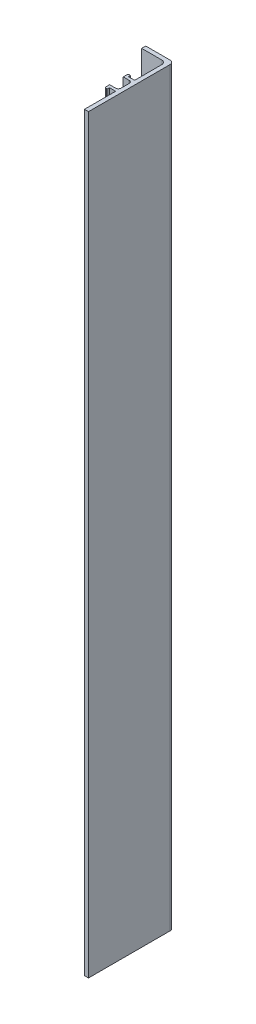
ISO-10303-21;
HEADER;
FILE_DESCRIPTION(('STEP AP214'),'2;1');
FILE_NAME('part.step','',(''),(''),'','','');
FILE_SCHEMA(('AUTOMOTIVE_DESIGN { 1 0 10303 214 1 1 1 1 }'));
ENDSEC;
DATA;
#1=APPLICATION_CONTEXT('core data for automotive mechanical design processes');
#2=APPLICATION_PROTOCOL_DEFINITION('international standard','automotive_design',2000,#1);
#3=PRODUCT_CONTEXT('',#1,'mechanical');
#4=PRODUCT('Part','Part','',(#3));
#5=PRODUCT_RELATED_PRODUCT_CATEGORY('part','',(#4));
#6=PRODUCT_DEFINITION_FORMATION('','',#4);
#7=PRODUCT_DEFINITION_CONTEXT('part definition',#1,'design');
#8=PRODUCT_DEFINITION('design','',#6,#7);
#9=PRODUCT_DEFINITION_SHAPE('','',#8);
#10=(LENGTH_UNIT() NAMED_UNIT(*) SI_UNIT(.MILLI.,.METRE.));
#11=(NAMED_UNIT(*) PLANE_ANGLE_UNIT() SI_UNIT($,.RADIAN.));
#12=(NAMED_UNIT(*) SI_UNIT($,.STERADIAN.) SOLID_ANGLE_UNIT());
#13=UNCERTAINTY_MEASURE_WITH_UNIT(LENGTH_MEASURE(1.E-05),#10,'distance_accuracy_value','');
#14=(GEOMETRIC_REPRESENTATION_CONTEXT(3) GLOBAL_UNCERTAINTY_ASSIGNED_CONTEXT((#13)) GLOBAL_UNIT_ASSIGNED_CONTEXT((#10,
#11,#12)) REPRESENTATION_CONTEXT('',''));
#15=CARTESIAN_POINT('',(0.,0.,0.));
#16=DIRECTION('',(0.,0.,1.));
#17=DIRECTION('',(1.,0.,0.));
#18=AXIS2_PLACEMENT_3D('',#15,#16,#17);
#19=CARTESIAN_POINT('',(-1.5,276.5,0.));
#20=DIRECTION('',(0.,0.,-1.));
#21=DIRECTION('',(-1.,0.,0.));
#22=AXIS2_PLACEMENT_3D('',#19,#20,#21);
#23=PLANE('',#22);
#24=DIRECTION('',(1.,0.,0.));
#25=VECTOR('',#24,1.);
#26=CARTESIAN_POINT('',(-1.5,0.,0.));
#27=LINE('',#26,#25);
#28=CARTESIAN_POINT('',(-1.5,0.,0.));
#29=VERTEX_POINT('',#28);
#30=CARTESIAN_POINT('',(0.,0.,0.));
#31=VERTEX_POINT('',#30);
#32=EDGE_CURVE('E220',#29,#31,#27,.T.);
#33=ORIENTED_EDGE('',*,*,#32,.T.);
#34=DIRECTION('',(0.,-1.,0.));
#35=VECTOR('',#34,1.);
#36=CARTESIAN_POINT('',(0.,276.5,0.));
#37=LINE('',#36,#35);
#38=CARTESIAN_POINT('',(0.,276.5,0.));
#39=VERTEX_POINT('',#38);
#40=EDGE_CURVE('E201',#39,#31,#37,.T.);
#41=ORIENTED_EDGE('',*,*,#40,.F.);
#42=DIRECTION('',(1.,0.,0.));
#43=VECTOR('',#42,1.);
#44=CARTESIAN_POINT('',(-1.5,276.5,0.));
#45=LINE('',#44,#43);
#46=CARTESIAN_POINT('',(-1.5,276.5,0.));
#47=VERTEX_POINT('',#46);
#48=EDGE_CURVE('E207',#47,#39,#45,.T.);
#49=ORIENTED_EDGE('',*,*,#48,.F.);
#50=DIRECTION('',(0.,-1.,0.));
#51=VECTOR('',#50,1.);
#52=CARTESIAN_POINT('',(-1.5,276.5,0.));
#53=LINE('',#52,#51);
#54=EDGE_CURVE('E367',#47,#29,#53,.T.);
#55=ORIENTED_EDGE('',*,*,#54,.T.);
#56=EDGE_LOOP('',(#33,#41,#49,#55));
#57=FACE_BOUND('',#56,.T.);
#58=ADVANCED_FACE('F39',(#57),#23,.F.);
#59=CARTESIAN_POINT('',(0.,276.5,0.));
#60=DIRECTION('',(-1.,0.,0.));
#61=DIRECTION('',(0.,0.,1.));
#62=AXIS2_PLACEMENT_3D('',#59,#60,#61);
#63=PLANE('',#62);
#64=DIRECTION('',(0.,0.,-1.));
#65=VECTOR('',#64,1.);
#66=CARTESIAN_POINT('',(0.,0.,0.));
#67=LINE('',#66,#65);
#68=CARTESIAN_POINT('',(0.,0.,-30.));
#69=VERTEX_POINT('',#68);
#70=EDGE_CURVE('E313',#31,#69,#67,.T.);
#71=ORIENTED_EDGE('',*,*,#70,.T.);
#72=DIRECTION('',(0.,-1.,0.));
#73=VECTOR('',#72,1.);
#74=CARTESIAN_POINT('',(0.,276.5,-30.));
#75=LINE('',#74,#73);
#76=CARTESIAN_POINT('',(0.,276.5,-30.));
#77=VERTEX_POINT('',#76);
#78=EDGE_CURVE('E48',#69,#77,#75,.F.);
#79=ORIENTED_EDGE('',*,*,#78,.T.);
#80=DIRECTION('',(0.,0.,-1.));
#81=VECTOR('',#80,1.);
#82=CARTESIAN_POINT('',(0.,276.5,0.));
#83=LINE('',#82,#81);
#84=EDGE_CURVE('E197',#39,#77,#83,.T.);
#85=ORIENTED_EDGE('',*,*,#84,.F.);
#86=ORIENTED_EDGE('',*,*,#40,.T.);
#87=EDGE_LOOP('',(#71,#79,#85,#86));
#88=FACE_BOUND('',#87,.T.);
#89=ADVANCED_FACE('F199',(#88),#63,.F.);
#90=CARTESIAN_POINT('',(0.,276.5,-31.5));
#91=DIRECTION('',(0.,0.,1.));
#92=DIRECTION('',(1.,0.,0.));
#93=AXIS2_PLACEMENT_3D('',#90,#91,#92);
#94=PLANE('',#93);
#95=DIRECTION('',(-1.,0.,0.));
#96=VECTOR('',#95,1.);
#97=CARTESIAN_POINT('',(0.,276.5,-31.5));
#98=LINE('',#97,#96);
#99=CARTESIAN_POINT('',(-1.5,276.5,-31.5));
#100=VERTEX_POINT('',#99);
#101=CARTESIAN_POINT('',(-10.4,276.5,-31.5));
#102=VERTEX_POINT('',#101);
#103=EDGE_CURVE('E206',#100,#102,#98,.T.);
#104=ORIENTED_EDGE('',*,*,#103,.F.);
#105=DIRECTION('',(0.,-1.,0.));
#106=VECTOR('',#105,1.);
#107=CARTESIAN_POINT('',(-1.5,276.5,-31.5));
#108=LINE('',#107,#106);
#109=CARTESIAN_POINT('',(-1.5,0.,-31.5));
#110=VERTEX_POINT('',#109);
#111=EDGE_CURVE('E295',#100,#110,#108,.T.);
#112=ORIENTED_EDGE('',*,*,#111,.T.);
#113=DIRECTION('',(-1.,0.,0.));
#114=VECTOR('',#113,1.);
#115=CARTESIAN_POINT('',(0.,0.,-31.5));
#116=LINE('',#115,#114);
#117=CARTESIAN_POINT('',(-10.4,0.,-31.5));
#118=VERTEX_POINT('',#117);
#119=EDGE_CURVE('E306',#110,#118,#116,.T.);
#120=ORIENTED_EDGE('',*,*,#119,.T.);
#121=DIRECTION('',(0.,-1.,0.));
#122=VECTOR('',#121,1.);
#123=CARTESIAN_POINT('',(-10.4,276.5,-31.5));
#124=LINE('',#123,#122);
#125=EDGE_CURVE('E223',#102,#118,#124,.T.);
#126=ORIENTED_EDGE('',*,*,#125,.F.);
#127=EDGE_LOOP('',(#104,#112,#120,#126));
#128=FACE_BOUND('',#127,.T.);
#129=ADVANCED_FACE('F304',(#128),#94,.F.);
#130=CARTESIAN_POINT('',(-10.4,276.5,-31.5));
#131=DIRECTION('',(1.,0.,0.));
#132=DIRECTION('',(0.,0.,-1.));
#133=AXIS2_PLACEMENT_3D('',#130,#131,#132);
#134=PLANE('',#133);
#135=DIRECTION('',(0.,0.,1.));
#136=VECTOR('',#135,1.);
#137=CARTESIAN_POINT('',(-10.4,0.,-31.5));
#138=LINE('',#137,#136);
#139=CARTESIAN_POINT('',(-10.4,0.,-30.));
#140=VERTEX_POINT('',#139);
#141=EDGE_CURVE('E311',#118,#140,#138,.T.);
#142=ORIENTED_EDGE('',*,*,#141,.T.);
#143=DIRECTION('',(0.,-1.,0.));
#144=VECTOR('',#143,1.);
#145=CARTESIAN_POINT('',(-10.4,276.5,-30.));
#146=LINE('',#145,#144);
#147=CARTESIAN_POINT('',(-10.4,276.5,-30.));
#148=VERTEX_POINT('',#147);
#149=EDGE_CURVE('E231',#148,#140,#146,.T.);
#150=ORIENTED_EDGE('',*,*,#149,.F.);
#151=DIRECTION('',(0.,0.,1.));
#152=VECTOR('',#151,1.);
#153=CARTESIAN_POINT('',(-10.4,276.5,-31.5));
#154=LINE('',#153,#152);
#155=EDGE_CURVE('E431',#102,#148,#154,.T.);
#156=ORIENTED_EDGE('',*,*,#155,.F.);
#157=ORIENTED_EDGE('',*,*,#125,.T.);
#158=EDGE_LOOP('',(#142,#150,#156,#157));
#159=FACE_BOUND('',#158,.T.);
#160=ADVANCED_FACE('F482',(#159),#134,.F.);
#161=CARTESIAN_POINT('',(-10.4,276.5,-30.));
#162=DIRECTION('',(0.,0.,-1.));
#163=DIRECTION('',(-1.,0.,0.));
#164=AXIS2_PLACEMENT_3D('',#161,#162,#163);
#165=PLANE('',#164);
#166=DIRECTION('',(1.,0.,0.));
#167=VECTOR('',#166,1.);
#168=CARTESIAN_POINT('',(-10.4,0.,-30.));
#169=LINE('',#168,#167);
#170=CARTESIAN_POINT('',(-3.,0.,-30.));
#171=VERTEX_POINT('',#170);
#172=EDGE_CURVE('E317',#140,#171,#169,.T.);
#173=ORIENTED_EDGE('',*,*,#172,.T.);
#174=DIRECTION('',(0.,-1.,0.));
#175=VECTOR('',#174,1.);
#176=CARTESIAN_POINT('',(-3.,276.5,-30.));
#177=LINE('',#176,#175);
#178=CARTESIAN_POINT('',(-3.,276.5,-30.));
#179=VERTEX_POINT('',#178);
#180=EDGE_CURVE('E286',#171,#179,#177,.F.);
#181=ORIENTED_EDGE('',*,*,#180,.T.);
#182=DIRECTION('',(1.,0.,0.));
#183=VECTOR('',#182,1.);
#184=CARTESIAN_POINT('',(-10.4,276.5,-30.));
#185=LINE('',#184,#183);
#186=EDGE_CURVE('E409',#148,#179,#185,.T.);
#187=ORIENTED_EDGE('',*,*,#186,.F.);
#188=ORIENTED_EDGE('',*,*,#149,.T.);
#189=EDGE_LOOP('',(#173,#181,#187,#188));
#190=FACE_BOUND('',#189,.T.);
#191=ADVANCED_FACE('F406',(#190),#165,.F.);
#192=CARTESIAN_POINT('',(-1.5,276.5,-30.));
#193=DIRECTION('',(1.,0.,0.));
#194=DIRECTION('',(0.,0.,-1.));
#195=AXIS2_PLACEMENT_3D('',#192,#193,#194);
#196=PLANE('',#195);
#197=DIRECTION('',(0.,0.,1.));
#198=VECTOR('',#197,1.);
#199=CARTESIAN_POINT('',(-1.5,276.5,-30.));
#200=LINE('',#199,#198);
#201=CARTESIAN_POINT('',(-1.5,276.5,-28.5));
#202=VERTEX_POINT('',#201);
#203=CARTESIAN_POINT('',(-1.5,276.5,-18.5));
#204=VERTEX_POINT('',#203);
#205=EDGE_CURVE('E422',#202,#204,#200,.T.);
#206=ORIENTED_EDGE('',*,*,#205,.F.);
#207=DIRECTION('',(0.,-1.,0.));
#208=VECTOR('',#207,1.);
#209=CARTESIAN_POINT('',(-1.5,0.,-28.5));
#210=LINE('',#209,#208);
#211=CARTESIAN_POINT('',(-1.5,0.,-28.5));
#212=VERTEX_POINT('',#211);
#213=EDGE_CURVE('E282',#202,#212,#210,.T.);
#214=ORIENTED_EDGE('',*,*,#213,.T.);
#215=DIRECTION('',(0.,0.,1.));
#216=VECTOR('',#215,1.);
#217=CARTESIAN_POINT('',(-1.5,0.,-30.));
#218=LINE('',#217,#216);
#219=CARTESIAN_POINT('',(-1.5,0.,-18.5));
#220=VERTEX_POINT('',#219);
#221=EDGE_CURVE('E325',#212,#220,#218,.T.);
#222=ORIENTED_EDGE('',*,*,#221,.T.);
#223=DIRECTION('',(0.,-1.,0.));
#224=VECTOR('',#223,1.);
#225=CARTESIAN_POINT('',(-1.5,276.5,-18.5));
#226=LINE('',#225,#224);
#227=EDGE_CURVE('E398',#204,#220,#226,.T.);
#228=ORIENTED_EDGE('',*,*,#227,.F.);
#229=EDGE_LOOP('',(#206,#214,#222,#228));
#230=FACE_BOUND('',#229,.T.);
#231=ADVANCED_FACE('F420',(#230),#196,.F.);
#232=CARTESIAN_POINT('',(-1.5,276.5,-18.5));
#233=DIRECTION('',(0.,0.,1.));
#234=DIRECTION('',(1.,0.,0.));
#235=AXIS2_PLACEMENT_3D('',#232,#233,#234);
#236=PLANE('',#235);
#237=DIRECTION('',(-1.,0.,0.));
#238=VECTOR('',#237,1.);
#239=CARTESIAN_POINT('',(-1.5,0.,-18.5));
#240=LINE('',#239,#238);
#241=CARTESIAN_POINT('',(-3.8,0.,-18.5));
#242=VERTEX_POINT('',#241);
#243=EDGE_CURVE('E328',#220,#242,#240,.T.);
#244=ORIENTED_EDGE('',*,*,#243,.T.);
#245=DIRECTION('',(0.,-1.,0.));
#246=VECTOR('',#245,1.);
#247=CARTESIAN_POINT('',(-3.8,276.5,-18.5));
#248=LINE('',#247,#246);
#249=CARTESIAN_POINT('',(-3.8,276.5,-18.5));
#250=VERTEX_POINT('',#249);
#251=EDGE_CURVE('E394',#250,#242,#248,.T.);
#252=ORIENTED_EDGE('',*,*,#251,.F.);
#253=DIRECTION('',(-1.,0.,0.));
#254=VECTOR('',#253,1.);
#255=CARTESIAN_POINT('',(-1.5,276.5,-18.5));
#256=LINE('',#255,#254);
#257=EDGE_CURVE('E425',#204,#250,#256,.T.);
#258=ORIENTED_EDGE('',*,*,#257,.F.);
#259=ORIENTED_EDGE('',*,*,#227,.T.);
#260=EDGE_LOOP('',(#244,#252,#258,#259));
#261=FACE_BOUND('',#260,.T.);
#262=ADVANCED_FACE('F567',(#261),#236,.F.);
#263=CARTESIAN_POINT('',(-3.8,276.5,-18.5));
#264=DIRECTION('',(-1.,0.,0.));
#265=DIRECTION('',(0.,0.,1.));
#266=AXIS2_PLACEMENT_3D('',#263,#264,#265);
#267=PLANE('',#266);
#268=DIRECTION('',(0.,0.,-1.));
#269=VECTOR('',#268,1.);
#270=CARTESIAN_POINT('',(-3.8,0.,-18.5));
#271=LINE('',#270,#269);
#272=CARTESIAN_POINT('',(-3.8,0.,-19.3));
#273=VERTEX_POINT('',#272);
#274=EDGE_CURVE('E331',#242,#273,#271,.T.);
#275=ORIENTED_EDGE('',*,*,#274,.T.);
#276=DIRECTION('',(0.,-1.,0.));
#277=VECTOR('',#276,1.);
#278=CARTESIAN_POINT('',(-3.8,276.5,-19.3));
#279=LINE('',#278,#277);
#280=CARTESIAN_POINT('',(-3.8,276.5,-19.3));
#281=VERTEX_POINT('',#280);
#282=EDGE_CURVE('E390',#281,#273,#279,.T.);
#283=ORIENTED_EDGE('',*,*,#282,.F.);
#284=DIRECTION('',(0.,0.,-1.));
#285=VECTOR('',#284,1.);
#286=CARTESIAN_POINT('',(-3.8,276.5,-18.5));
#287=LINE('',#286,#285);
#288=EDGE_CURVE('E429',#250,#281,#287,.T.);
#289=ORIENTED_EDGE('',*,*,#288,.F.);
#290=ORIENTED_EDGE('',*,*,#251,.T.);
#291=EDGE_LOOP('',(#275,#283,#289,#290));
#292=FACE_BOUND('',#291,.T.);
#293=ADVANCED_FACE('F670',(#292),#267,.F.);
#294=CARTESIAN_POINT('',(-4.7,276.5,-19.3));
#295=DIRECTION('',(0.,0.,1.));
#296=DIRECTION('',(1.,0.,0.));
#297=AXIS2_PLACEMENT_3D('',#294,#295,#296);
#298=PLANE('',#297);
#299=DIRECTION('',(-1.,0.,0.));
#300=VECTOR('',#299,1.);
#301=CARTESIAN_POINT('',(-4.7,0.,-19.3));
#302=LINE('',#301,#300);
#303=CARTESIAN_POINT('',(-4.2,0.,-19.3));
#304=VERTEX_POINT('',#303);
#305=EDGE_CURVE('E334',#273,#304,#302,.T.);
#306=ORIENTED_EDGE('',*,*,#305,.T.);
#307=DIRECTION('',(0.,-1.,0.));
#308=VECTOR('',#307,1.);
#309=CARTESIAN_POINT('',(-4.2,276.5,-19.3));
#310=LINE('',#309,#308);
#311=CARTESIAN_POINT('',(-4.2,276.5,-19.3));
#312=VERTEX_POINT('',#311);
#313=EDGE_CURVE('E253',#304,#312,#310,.F.);
#314=ORIENTED_EDGE('',*,*,#313,.T.);
#315=DIRECTION('',(-1.,0.,0.));
#316=VECTOR('',#315,1.);
#317=CARTESIAN_POINT('',(-4.7,276.5,-19.3));
#318=LINE('',#317,#316);
#319=EDGE_CURVE('E437',#281,#312,#318,.T.);
#320=ORIENTED_EDGE('',*,*,#319,.F.);
#321=ORIENTED_EDGE('',*,*,#282,.T.);
#322=EDGE_LOOP('',(#306,#314,#320,#321));
#323=FACE_BOUND('',#322,.T.);
#324=ADVANCED_FACE('F660',(#323),#298,.F.);
#325=CARTESIAN_POINT('',(-4.7,276.5,-19.3));
#326=DIRECTION('',(1.,0.,0.));
#327=DIRECTION('',(0.,0.,-1.));
#328=AXIS2_PLACEMENT_3D('',#325,#326,#327);
#329=PLANE('',#328);
#330=DIRECTION('',(0.,0.,1.));
#331=VECTOR('',#330,1.);
#332=CARTESIAN_POINT('',(-4.7,276.5,-19.3));
#333=LINE('',#332,#331);
#334=CARTESIAN_POINT('',(-4.7,276.5,-18.8));
#335=VERTEX_POINT('',#334);
#336=CARTESIAN_POINT('',(-4.7,276.5,-17.5));
#337=VERTEX_POINT('',#336);
#338=EDGE_CURVE('E441',#335,#337,#333,.T.);
#339=ORIENTED_EDGE('',*,*,#338,.F.);
#340=DIRECTION('',(0.,-1.,0.));
#341=VECTOR('',#340,1.);
#342=CARTESIAN_POINT('',(-4.7,276.5,-18.8));
#343=LINE('',#342,#341);
#344=CARTESIAN_POINT('',(-4.7,0.,-18.8));
#345=VERTEX_POINT('',#344);
#346=EDGE_CURVE('E249',#335,#345,#343,.T.);
#347=ORIENTED_EDGE('',*,*,#346,.T.);
#348=DIRECTION('',(0.,0.,1.));
#349=VECTOR('',#348,1.);
#350=CARTESIAN_POINT('',(-4.7,0.,-19.3));
#351=LINE('',#350,#349);
#352=CARTESIAN_POINT('',(-4.7,0.,-17.5));
#353=VERTEX_POINT('',#352);
#354=EDGE_CURVE('E338',#345,#353,#351,.T.);
#355=ORIENTED_EDGE('',*,*,#354,.T.);
#356=DIRECTION('',(0.,-1.,0.));
#357=VECTOR('',#356,1.);
#358=CARTESIAN_POINT('',(-4.7,276.5,-17.5));
#359=LINE('',#358,#357);
#360=EDGE_CURVE('E386',#337,#353,#359,.T.);
#361=ORIENTED_EDGE('',*,*,#360,.F.);
#362=EDGE_LOOP('',(#339,#347,#355,#361));
#363=FACE_BOUND('',#362,.T.);
#364=ADVANCED_FACE('F620',(#363),#329,.F.);
#365=CARTESIAN_POINT('',(-4.7,276.5,-17.5));
#366=DIRECTION('',(0.,0.,-1.));
#367=DIRECTION('',(-1.,0.,0.));
#368=AXIS2_PLACEMENT_3D('',#365,#366,#367);
#369=PLANE('',#368);
#370=DIRECTION('',(1.,0.,0.));
#371=VECTOR('',#370,1.);
#372=CARTESIAN_POINT('',(-4.7,0.,-17.5));
#373=LINE('',#372,#371);
#374=CARTESIAN_POINT('',(-2.5,0.,-17.5));
#375=VERTEX_POINT('',#374);
#376=EDGE_CURVE('E341',#353,#375,#373,.T.);
#377=ORIENTED_EDGE('',*,*,#376,.T.);
#378=DIRECTION('',(0.,-1.,0.));
#379=VECTOR('',#378,1.);
#380=CARTESIAN_POINT('',(-2.5,276.5,-17.5));
#381=LINE('',#380,#379);
#382=CARTESIAN_POINT('',(-2.5,276.5,-17.5));
#383=VERTEX_POINT('',#382);
#384=EDGE_CURVE('E267',#375,#383,#381,.F.);
#385=ORIENTED_EDGE('',*,*,#384,.T.);
#386=DIRECTION('',(1.,0.,0.));
#387=VECTOR('',#386,1.);
#388=CARTESIAN_POINT('',(-4.7,276.5,-17.5));
#389=LINE('',#388,#387);
#390=EDGE_CURVE('E444',#337,#383,#389,.T.);
#391=ORIENTED_EDGE('',*,*,#390,.F.);
#392=ORIENTED_EDGE('',*,*,#360,.T.);
#393=EDGE_LOOP('',(#377,#385,#391,#392));
#394=FACE_BOUND('',#393,.T.);
#395=ADVANCED_FACE('F610',(#394),#369,.F.);
#396=CARTESIAN_POINT('',(-1.5,276.5,-17.5));
#397=DIRECTION('',(1.,0.,0.));
#398=DIRECTION('',(0.,0.,-1.));
#399=AXIS2_PLACEMENT_3D('',#396,#397,#398);
#400=PLANE('',#399);
#401=DIRECTION('',(0.,0.,1.));
#402=VECTOR('',#401,1.);
#403=CARTESIAN_POINT('',(-1.5,0.,-17.5));
#404=LINE('',#403,#402);
#405=CARTESIAN_POINT('',(-1.5,0.,-16.5));
#406=VERTEX_POINT('',#405);
#407=CARTESIAN_POINT('',(-1.5,0.,-13.5));
#408=VERTEX_POINT('',#407);
#409=EDGE_CURVE('E345',#406,#408,#404,.T.);
#410=ORIENTED_EDGE('',*,*,#409,.T.);
#411=DIRECTION('',(0.,-1.,0.));
#412=VECTOR('',#411,1.);
#413=CARTESIAN_POINT('',(-1.5,276.5,-13.5));
#414=LINE('',#413,#412);
#415=CARTESIAN_POINT('',(-1.5,276.5,-13.5));
#416=VERTEX_POINT('',#415);
#417=EDGE_CURVE('E264',#408,#416,#414,.F.);
#418=ORIENTED_EDGE('',*,*,#417,.T.);
#419=DIRECTION('',(0.,0.,1.));
#420=VECTOR('',#419,1.);
#421=CARTESIAN_POINT('',(-1.5,276.5,-17.5));
#422=LINE('',#421,#420);
#423=CARTESIAN_POINT('',(-1.5,276.5,-16.5));
#424=VERTEX_POINT('',#423);
#425=EDGE_CURVE('E448',#424,#416,#422,.T.);
#426=ORIENTED_EDGE('',*,*,#425,.F.);
#427=DIRECTION('',(0.,-1.,0.));
#428=VECTOR('',#427,1.);
#429=CARTESIAN_POINT('',(-1.5,0.,-16.5));
#430=LINE('',#429,#428);
#431=EDGE_CURVE('E260',#424,#406,#430,.T.);
#432=ORIENTED_EDGE('',*,*,#431,.T.);
#433=EDGE_LOOP('',(#410,#418,#426,#432));
#434=FACE_BOUND('',#433,.T.);
#435=ADVANCED_FACE('F598',(#434),#400,.F.);
#436=CARTESIAN_POINT('',(-1.5,276.5,-12.5));
#437=DIRECTION('',(0.,0.,1.));
#438=DIRECTION('',(1.,0.,0.));
#439=AXIS2_PLACEMENT_3D('',#436,#437,#438);
#440=PLANE('',#439);
#441=DIRECTION('',(-1.,0.,0.));
#442=VECTOR('',#441,1.);
#443=CARTESIAN_POINT('',(-1.5,276.5,-12.5));
#444=LINE('',#443,#442);
#445=CARTESIAN_POINT('',(-2.5,276.5,-12.5));
#446=VERTEX_POINT('',#445);
#447=CARTESIAN_POINT('',(-4.7,276.5,-12.5));
#448=VERTEX_POINT('',#447);
#449=EDGE_CURVE('E452',#446,#448,#444,.T.);
#450=ORIENTED_EDGE('',*,*,#449,.F.);
#451=DIRECTION('',(0.,-1.,0.));
#452=VECTOR('',#451,1.);
#453=CARTESIAN_POINT('',(-2.5,0.,-12.5));
#454=LINE('',#453,#452);
#455=CARTESIAN_POINT('',(-2.5,0.,-12.5));
#456=VERTEX_POINT('',#455);
#457=EDGE_CURVE('E256',#446,#456,#454,.T.);
#458=ORIENTED_EDGE('',*,*,#457,.T.);
#459=DIRECTION('',(-1.,0.,0.));
#460=VECTOR('',#459,1.);
#461=CARTESIAN_POINT('',(-1.5,0.,-12.5));
#462=LINE('',#461,#460);
#463=CARTESIAN_POINT('',(-4.7,0.,-12.5));
#464=VERTEX_POINT('',#463);
#465=EDGE_CURVE('E349',#456,#464,#462,.T.);
#466=ORIENTED_EDGE('',*,*,#465,.T.);
#467=DIRECTION('',(0.,-1.,0.));
#468=VECTOR('',#467,1.);
#469=CARTESIAN_POINT('',(-4.7,276.5,-12.5));
#470=LINE('',#469,#468);
#471=EDGE_CURVE('E382',#448,#464,#470,.T.);
#472=ORIENTED_EDGE('',*,*,#471,.F.);
#473=EDGE_LOOP('',(#450,#458,#466,#472));
#474=FACE_BOUND('',#473,.T.);
#475=ADVANCED_FACE('F592',(#474),#440,.F.);
#476=CARTESIAN_POINT('',(-4.7,276.5,-12.5));
#477=DIRECTION('',(1.,0.,0.));
#478=DIRECTION('',(0.,0.,-1.));
#479=AXIS2_PLACEMENT_3D('',#476,#477,#478);
#480=PLANE('',#479);
#481=DIRECTION('',(0.,0.,1.));
#482=VECTOR('',#481,1.);
#483=CARTESIAN_POINT('',(-4.7,0.,-12.5));
#484=LINE('',#483,#482);
#485=CARTESIAN_POINT('',(-4.7,0.,-11.2));
#486=VERTEX_POINT('',#485);
#487=EDGE_CURVE('E352',#464,#486,#484,.T.);
#488=ORIENTED_EDGE('',*,*,#487,.T.);
#489=DIRECTION('',(0.,-1.,0.));
#490=VECTOR('',#489,1.);
#491=CARTESIAN_POINT('',(-4.7,276.5,-11.2));
#492=LINE('',#491,#490);
#493=CARTESIAN_POINT('',(-4.7,276.5,-11.2));
#494=VERTEX_POINT('',#493);
#495=EDGE_CURVE('E240',#486,#494,#492,.F.);
#496=ORIENTED_EDGE('',*,*,#495,.T.);
#497=DIRECTION('',(0.,0.,1.));
#498=VECTOR('',#497,1.);
#499=CARTESIAN_POINT('',(-4.7,276.5,-12.5));
#500=LINE('',#499,#498);
#501=EDGE_CURVE('E455',#448,#494,#500,.T.);
#502=ORIENTED_EDGE('',*,*,#501,.F.);
#503=ORIENTED_EDGE('',*,*,#471,.T.);
#504=EDGE_LOOP('',(#488,#496,#502,#503));
#505=FACE_BOUND('',#504,.T.);
#506=ADVANCED_FACE('F597',(#505),#480,.F.);
#507=CARTESIAN_POINT('',(-4.7,276.5,-10.7));
#508=DIRECTION('',(0.,0.,-1.));
#509=DIRECTION('',(-1.,0.,0.));
#510=AXIS2_PLACEMENT_3D('',#507,#508,#509);
#511=PLANE('',#510);
#512=DIRECTION('',(1.,0.,0.));
#513=VECTOR('',#512,1.);
#514=CARTESIAN_POINT('',(-4.7,276.5,-10.7));
#515=LINE('',#514,#513);
#516=CARTESIAN_POINT('',(-4.2,276.5,-10.7));
#517=VERTEX_POINT('',#516);
#518=CARTESIAN_POINT('',(-3.8,276.5,-10.7));
#519=VERTEX_POINT('',#518);
#520=EDGE_CURVE('E459',#517,#519,#515,.T.);
#521=ORIENTED_EDGE('',*,*,#520,.F.);
#522=DIRECTION('',(0.,-1.,0.));
#523=VECTOR('',#522,1.);
#524=CARTESIAN_POINT('',(-4.2,276.5,-10.7));
#525=LINE('',#524,#523);
#526=CARTESIAN_POINT('',(-4.2,0.,-10.7));
#527=VERTEX_POINT('',#526);
#528=EDGE_CURVE('E222',#517,#527,#525,.T.);
#529=ORIENTED_EDGE('',*,*,#528,.T.);
#530=DIRECTION('',(1.,0.,0.));
#531=VECTOR('',#530,1.);
#532=CARTESIAN_POINT('',(-4.7,0.,-10.7));
#533=LINE('',#532,#531);
#534=CARTESIAN_POINT('',(-3.8,0.,-10.7));
#535=VERTEX_POINT('',#534);
#536=EDGE_CURVE('E356',#527,#535,#533,.T.);
#537=ORIENTED_EDGE('',*,*,#536,.T.);
#538=DIRECTION('',(0.,-1.,0.));
#539=VECTOR('',#538,1.);
#540=CARTESIAN_POINT('',(-3.8,276.5,-10.7));
#541=LINE('',#540,#539);
#542=EDGE_CURVE('E378',#519,#535,#541,.T.);
#543=ORIENTED_EDGE('',*,*,#542,.F.);
#544=EDGE_LOOP('',(#521,#529,#537,#543));
#545=FACE_BOUND('',#544,.T.);
#546=ADVANCED_FACE('F638',(#545),#511,.F.);
#547=CARTESIAN_POINT('',(-3.8,276.5,-11.5));
#548=DIRECTION('',(-1.,0.,0.));
#549=DIRECTION('',(0.,0.,1.));
#550=AXIS2_PLACEMENT_3D('',#547,#548,#549);
#551=PLANE('',#550);
#552=DIRECTION('',(0.,0.,-1.));
#553=VECTOR('',#552,1.);
#554=CARTESIAN_POINT('',(-3.8,0.,-11.5));
#555=LINE('',#554,#553);
#556=CARTESIAN_POINT('',(-3.8,0.,-11.5));
#557=VERTEX_POINT('',#556);
#558=EDGE_CURVE('E359',#535,#557,#555,.T.);
#559=ORIENTED_EDGE('',*,*,#558,.T.);
#560=DIRECTION('',(0.,-1.,0.));
#561=VECTOR('',#560,1.);
#562=CARTESIAN_POINT('',(-3.8,276.5,-11.5));
#563=LINE('',#562,#561);
#564=CARTESIAN_POINT('',(-3.8,276.5,-11.5));
#565=VERTEX_POINT('',#564);
#566=EDGE_CURVE('E374',#565,#557,#563,.T.);
#567=ORIENTED_EDGE('',*,*,#566,.F.);
#568=DIRECTION('',(0.,0.,-1.));
#569=VECTOR('',#568,1.);
#570=CARTESIAN_POINT('',(-3.8,276.5,-11.5));
#571=LINE('',#570,#569);
#572=EDGE_CURVE('E462',#519,#565,#571,.T.);
#573=ORIENTED_EDGE('',*,*,#572,.F.);
#574=ORIENTED_EDGE('',*,*,#542,.T.);
#575=EDGE_LOOP('',(#559,#567,#573,#574));
#576=FACE_BOUND('',#575,.T.);
#577=ADVANCED_FACE('F643',(#576),#551,.F.);
#578=CARTESIAN_POINT('',(-3.8,276.5,-11.5));
#579=DIRECTION('',(0.,0.,-1.));
#580=DIRECTION('',(-1.,0.,0.));
#581=AXIS2_PLACEMENT_3D('',#578,#579,#580);
#582=PLANE('',#581);
#583=DIRECTION('',(1.,0.,0.));
#584=VECTOR('',#583,1.);
#585=CARTESIAN_POINT('',(-3.8,0.,-11.5));
#586=LINE('',#585,#584);
#587=CARTESIAN_POINT('',(-1.5,0.,-11.5));
#588=VERTEX_POINT('',#587);
#589=EDGE_CURVE('E362',#557,#588,#586,.T.);
#590=ORIENTED_EDGE('',*,*,#589,.T.);
#591=DIRECTION('',(0.,-1.,0.));
#592=VECTOR('',#591,1.);
#593=CARTESIAN_POINT('',(-1.5,276.5,-11.5));
#594=LINE('',#593,#592);
#595=CARTESIAN_POINT('',(-1.5,276.5,-11.5));
#596=VERTEX_POINT('',#595);
#597=EDGE_CURVE('E370',#596,#588,#594,.T.);
#598=ORIENTED_EDGE('',*,*,#597,.F.);
#599=DIRECTION('',(1.,0.,0.));
#600=VECTOR('',#599,1.);
#601=CARTESIAN_POINT('',(-3.8,276.5,-11.5));
#602=LINE('',#601,#600);
#603=EDGE_CURVE('E465',#565,#596,#602,.T.);
#604=ORIENTED_EDGE('',*,*,#603,.F.);
#605=ORIENTED_EDGE('',*,*,#566,.T.);
#606=EDGE_LOOP('',(#590,#598,#604,#605));
#607=FACE_BOUND('',#606,.T.);
#608=ADVANCED_FACE('F475',(#607),#582,.F.);
#609=CARTESIAN_POINT('',(-1.5,276.5,-11.5));
#610=DIRECTION('',(1.,0.,0.));
#611=DIRECTION('',(0.,0.,-1.));
#612=AXIS2_PLACEMENT_3D('',#609,#610,#611);
#613=PLANE('',#612);
#614=DIRECTION('',(0.,0.,1.));
#615=VECTOR('',#614,1.);
#616=CARTESIAN_POINT('',(-1.5,0.,-11.5));
#617=LINE('',#616,#615);
#618=EDGE_CURVE('E217',#588,#29,#617,.T.);
#619=ORIENTED_EDGE('',*,*,#618,.T.);
#620=ORIENTED_EDGE('',*,*,#54,.F.);
#621=DIRECTION('',(0.,0.,1.));
#622=VECTOR('',#621,1.);
#623=CARTESIAN_POINT('',(-1.5,276.5,-11.5));
#624=LINE('',#623,#622);
#625=EDGE_CURVE('E212',#596,#47,#624,.T.);
#626=ORIENTED_EDGE('',*,*,#625,.F.);
#627=ORIENTED_EDGE('',*,*,#597,.T.);
#628=EDGE_LOOP('',(#619,#620,#626,#627));
#629=FACE_BOUND('',#628,.T.);
#630=ADVANCED_FACE('F479',(#629),#613,.F.);
#631=CARTESIAN_POINT('',(0.,276.5,0.));
#632=DIRECTION('',(0.,1.,0.));
#633=DIRECTION('',(0.,0.,1.));
#634=AXIS2_PLACEMENT_3D('',#631,#632,#633);
#635=PLANE('',#634);
#636=ORIENTED_EDGE('',*,*,#84,.T.);
#637=CARTESIAN_POINT('',(-1.5,276.5,-30.));
#638=DIRECTION('',(0.,1.,0.));
#639=DIRECTION('',(0.,0.,1.));
#640=AXIS2_PLACEMENT_3D('',#637,#638,#639);
#641=CIRCLE('',#640,1.5);
#642=EDGE_CURVE('E11',#77,#100,#641,.T.);
#643=ORIENTED_EDGE('',*,*,#642,.T.);
#644=ORIENTED_EDGE('',*,*,#103,.T.);
#645=ORIENTED_EDGE('',*,*,#155,.T.);
#646=ORIENTED_EDGE('',*,*,#186,.T.);
#647=CARTESIAN_POINT('',(-3.,276.5,-28.5));
#648=DIRECTION('',(0.,1.,0.));
#649=DIRECTION('',(0.,0.,1.));
#650=AXIS2_PLACEMENT_3D('',#647,#648,#649);
#651=CIRCLE('',#650,1.5);
#652=EDGE_CURVE('E292',#179,#202,#651,.F.);
#653=ORIENTED_EDGE('',*,*,#652,.T.);
#654=ORIENTED_EDGE('',*,*,#205,.T.);
#655=ORIENTED_EDGE('',*,*,#257,.T.);
#656=ORIENTED_EDGE('',*,*,#288,.T.);
#657=ORIENTED_EDGE('',*,*,#319,.T.);
#658=CARTESIAN_POINT('',(-4.2,276.5,-18.8));
#659=DIRECTION('',(0.,1.,0.));
#660=DIRECTION('',(0.,0.,1.));
#661=AXIS2_PLACEMENT_3D('',#658,#659,#660);
#662=CIRCLE('',#661,0.5);
#663=EDGE_CURVE('E243',#312,#335,#662,.T.);
#664=ORIENTED_EDGE('',*,*,#663,.T.);
#665=ORIENTED_EDGE('',*,*,#338,.T.);
#666=ORIENTED_EDGE('',*,*,#390,.T.);
#667=CARTESIAN_POINT('',(-2.5,276.5,-16.5));
#668=DIRECTION('',(0.,1.,0.));
#669=DIRECTION('',(0.,0.,1.));
#670=AXIS2_PLACEMENT_3D('',#667,#668,#669);
#671=CIRCLE('',#670,1.);
#672=EDGE_CURVE('E279',#383,#424,#671,.F.);
#673=ORIENTED_EDGE('',*,*,#672,.T.);
#674=ORIENTED_EDGE('',*,*,#425,.T.);
#675=CARTESIAN_POINT('',(-2.5,276.5,-13.5));
#676=DIRECTION('',(0.,1.,0.));
#677=DIRECTION('',(0.,0.,1.));
#678=AXIS2_PLACEMENT_3D('',#675,#676,#677);
#679=CIRCLE('',#678,1.);
#680=EDGE_CURVE('E273',#416,#446,#679,.F.);
#681=ORIENTED_EDGE('',*,*,#680,.T.);
#682=ORIENTED_EDGE('',*,*,#449,.T.);
#683=ORIENTED_EDGE('',*,*,#501,.T.);
#684=CARTESIAN_POINT('',(-4.2,276.5,-11.2));
#685=DIRECTION('',(0.,1.,0.));
#686=DIRECTION('',(0.,0.,1.));
#687=AXIS2_PLACEMENT_3D('',#684,#685,#686);
#688=CIRCLE('',#687,0.5);
#689=EDGE_CURVE('E246',#494,#517,#688,.T.);
#690=ORIENTED_EDGE('',*,*,#689,.T.);
#691=ORIENTED_EDGE('',*,*,#520,.T.);
#692=ORIENTED_EDGE('',*,*,#572,.T.);
#693=ORIENTED_EDGE('',*,*,#603,.T.);
#694=ORIENTED_EDGE('',*,*,#625,.T.);
#695=ORIENTED_EDGE('',*,*,#48,.T.);
#696=EDGE_LOOP('',(#636,#643,#644,#645,#646,#653,#654,#655,#656,#657,#664,#665,#666,#673,#674,
#681,#682,#683,#690,#691,#692,#693,#694,#695));
#697=FACE_BOUND('',#696,.T.);
#698=ADVANCED_FACE('F210',(#697),#635,.T.);
#699=CARTESIAN_POINT('',(0.,0.,0.));
#700=DIRECTION('',(0.,1.,0.));
#701=DIRECTION('',(0.,0.,1.));
#702=AXIS2_PLACEMENT_3D('',#699,#700,#701);
#703=PLANE('',#702);
#704=ORIENTED_EDGE('',*,*,#119,.F.);
#705=CARTESIAN_POINT('',(-1.5,0.,-30.));
#706=DIRECTION('',(0.,1.,0.));
#707=DIRECTION('',(0.,0.,1.));
#708=AXIS2_PLACEMENT_3D('',#705,#706,#707);
#709=CIRCLE('',#708,1.5);
#710=EDGE_CURVE('E62',#110,#69,#709,.F.);
#711=ORIENTED_EDGE('',*,*,#710,.T.);
#712=ORIENTED_EDGE('',*,*,#70,.F.);
#713=ORIENTED_EDGE('',*,*,#32,.F.);
#714=ORIENTED_EDGE('',*,*,#618,.F.);
#715=ORIENTED_EDGE('',*,*,#589,.F.);
#716=ORIENTED_EDGE('',*,*,#558,.F.);
#717=ORIENTED_EDGE('',*,*,#536,.F.);
#718=CARTESIAN_POINT('',(-4.2,0.,-11.2));
#719=DIRECTION('',(0.,1.,0.));
#720=DIRECTION('',(0.,0.,1.));
#721=AXIS2_PLACEMENT_3D('',#718,#719,#720);
#722=CIRCLE('',#721,0.5);
#723=EDGE_CURVE('E237',#527,#486,#722,.F.);
#724=ORIENTED_EDGE('',*,*,#723,.T.);
#725=ORIENTED_EDGE('',*,*,#487,.F.);
#726=ORIENTED_EDGE('',*,*,#465,.F.);
#727=CARTESIAN_POINT('',(-2.5,0.,-13.5));
#728=DIRECTION('',(0.,1.,0.));
#729=DIRECTION('',(0.,0.,1.));
#730=AXIS2_PLACEMENT_3D('',#727,#728,#729);
#731=CIRCLE('',#730,1.);
#732=EDGE_CURVE('E270',#456,#408,#731,.T.);
#733=ORIENTED_EDGE('',*,*,#732,.T.);
#734=ORIENTED_EDGE('',*,*,#409,.F.);
#735=CARTESIAN_POINT('',(-2.5,0.,-16.5));
#736=DIRECTION('',(0.,1.,0.));
#737=DIRECTION('',(0.,0.,1.));
#738=AXIS2_PLACEMENT_3D('',#735,#736,#737);
#739=CIRCLE('',#738,1.);
#740=EDGE_CURVE('E276',#406,#375,#739,.T.);
#741=ORIENTED_EDGE('',*,*,#740,.T.);
#742=ORIENTED_EDGE('',*,*,#376,.F.);
#743=ORIENTED_EDGE('',*,*,#354,.F.);
#744=CARTESIAN_POINT('',(-4.2,0.,-18.8));
#745=DIRECTION('',(0.,1.,0.));
#746=DIRECTION('',(0.,0.,1.));
#747=AXIS2_PLACEMENT_3D('',#744,#745,#746);
#748=CIRCLE('',#747,0.5);
#749=EDGE_CURVE('E228',#345,#304,#748,.F.);
#750=ORIENTED_EDGE('',*,*,#749,.T.);
#751=ORIENTED_EDGE('',*,*,#305,.F.);
#752=ORIENTED_EDGE('',*,*,#274,.F.);
#753=ORIENTED_EDGE('',*,*,#243,.F.);
#754=ORIENTED_EDGE('',*,*,#221,.F.);
#755=CARTESIAN_POINT('',(-3.,0.,-28.5));
#756=DIRECTION('',(0.,1.,0.));
#757=DIRECTION('',(0.,0.,1.));
#758=AXIS2_PLACEMENT_3D('',#755,#756,#757);
#759=CIRCLE('',#758,1.5);
#760=EDGE_CURVE('E289',#212,#171,#759,.T.);
#761=ORIENTED_EDGE('',*,*,#760,.T.);
#762=ORIENTED_EDGE('',*,*,#172,.F.);
#763=ORIENTED_EDGE('',*,*,#141,.F.);
#764=EDGE_LOOP('',(#704,#711,#712,#713,#714,#715,#716,#717,#724,#725,#726,#733,#734,#741,#742,
#743,#750,#751,#752,#753,#754,#761,#762,#763));
#765=FACE_BOUND('',#764,.T.);
#766=ADVANCED_FACE('F309',(#765),#703,.F.);
#767=CARTESIAN_POINT('',(-4.2,276.5,-11.2));
#768=DIRECTION('',(0.,-1.,0.));
#769=DIRECTION('',(0.,0.,-1.));
#770=AXIS2_PLACEMENT_3D('',#767,#768,#769);
#771=CYLINDRICAL_SURFACE('',#770,0.5);
#772=ORIENTED_EDGE('',*,*,#689,.F.);
#773=ORIENTED_EDGE('',*,*,#495,.F.);
#774=ORIENTED_EDGE('',*,*,#723,.F.);
#775=ORIENTED_EDGE('',*,*,#528,.F.);
#776=EDGE_LOOP('',(#772,#773,#774,#775));
#777=FACE_BOUND('',#776,.T.);
#778=ADVANCED_FACE('F499',(#777),#771,.T.);
#779=CARTESIAN_POINT('',(-4.2,276.5,-18.8));
#780=DIRECTION('',(0.,-1.,0.));
#781=DIRECTION('',(0.,0.,-1.));
#782=AXIS2_PLACEMENT_3D('',#779,#780,#781);
#783=CYLINDRICAL_SURFACE('',#782,0.5);
#784=ORIENTED_EDGE('',*,*,#663,.F.);
#785=ORIENTED_EDGE('',*,*,#313,.F.);
#786=ORIENTED_EDGE('',*,*,#749,.F.);
#787=ORIENTED_EDGE('',*,*,#346,.F.);
#788=EDGE_LOOP('',(#784,#785,#786,#787));
#789=FACE_BOUND('',#788,.T.);
#790=ADVANCED_FACE('F502',(#789),#783,.T.);
#791=CARTESIAN_POINT('',(-2.5,276.5,-13.5));
#792=DIRECTION('',(0.,1.,0.));
#793=DIRECTION('',(0.,0.,1.));
#794=AXIS2_PLACEMENT_3D('',#791,#792,#793);
#795=CYLINDRICAL_SURFACE('',#794,1.);
#796=ORIENTED_EDGE('',*,*,#680,.F.);
#797=ORIENTED_EDGE('',*,*,#417,.F.);
#798=ORIENTED_EDGE('',*,*,#732,.F.);
#799=ORIENTED_EDGE('',*,*,#457,.F.);
#800=EDGE_LOOP('',(#796,#797,#798,#799));
#801=FACE_BOUND('',#800,.T.);
#802=ADVANCED_FACE('F506',(#801),#795,.F.);
#803=CARTESIAN_POINT('',(-2.5,276.5,-16.5));
#804=DIRECTION('',(0.,1.,0.));
#805=DIRECTION('',(0.,0.,1.));
#806=AXIS2_PLACEMENT_3D('',#803,#804,#805);
#807=CYLINDRICAL_SURFACE('',#806,1.);
#808=ORIENTED_EDGE('',*,*,#672,.F.);
#809=ORIENTED_EDGE('',*,*,#384,.F.);
#810=ORIENTED_EDGE('',*,*,#740,.F.);
#811=ORIENTED_EDGE('',*,*,#431,.F.);
#812=EDGE_LOOP('',(#808,#809,#810,#811));
#813=FACE_BOUND('',#812,.T.);
#814=ADVANCED_FACE('F510',(#813),#807,.F.);
#815=CARTESIAN_POINT('',(-3.,276.5,-28.5));
#816=DIRECTION('',(0.,1.,0.));
#817=DIRECTION('',(0.,0.,1.));
#818=AXIS2_PLACEMENT_3D('',#815,#816,#817);
#819=CYLINDRICAL_SURFACE('',#818,1.5);
#820=ORIENTED_EDGE('',*,*,#652,.F.);
#821=ORIENTED_EDGE('',*,*,#180,.F.);
#822=ORIENTED_EDGE('',*,*,#760,.F.);
#823=ORIENTED_EDGE('',*,*,#213,.F.);
#824=EDGE_LOOP('',(#820,#821,#822,#823));
#825=FACE_BOUND('',#824,.T.);
#826=ADVANCED_FACE('F417',(#825),#819,.F.);
#827=CARTESIAN_POINT('',(-1.5,276.5,-30.));
#828=DIRECTION('',(0.,-1.,0.));
#829=DIRECTION('',(0.,0.,-1.));
#830=AXIS2_PLACEMENT_3D('',#827,#828,#829);
#831=CYLINDRICAL_SURFACE('',#830,1.5);
#832=ORIENTED_EDGE('',*,*,#642,.F.);
#833=ORIENTED_EDGE('',*,*,#78,.F.);
#834=ORIENTED_EDGE('',*,*,#710,.F.);
#835=ORIENTED_EDGE('',*,*,#111,.F.);
#836=EDGE_LOOP('',(#832,#833,#834,#835));
#837=FACE_BOUND('',#836,.T.);
#838=ADVANCED_FACE('F41',(#837),#831,.T.);
#839=CLOSED_SHELL('',(#58,#89,#129,#160,#191,#231,#262,#293,#324,#364,#395,#435,#475,#506,#546,
#577,#608,#630,#698,#766,#778,#790,#802,#814,#826,#838));
#840=MANIFOLD_SOLID_BREP('B2',#839);
#841=ADVANCED_BREP_SHAPE_REPRESENTATION('',(#18,#840),#14);
#842=SHAPE_DEFINITION_REPRESENTATION(#9,#841);
ENDSEC;
END-ISO-10303-21;
